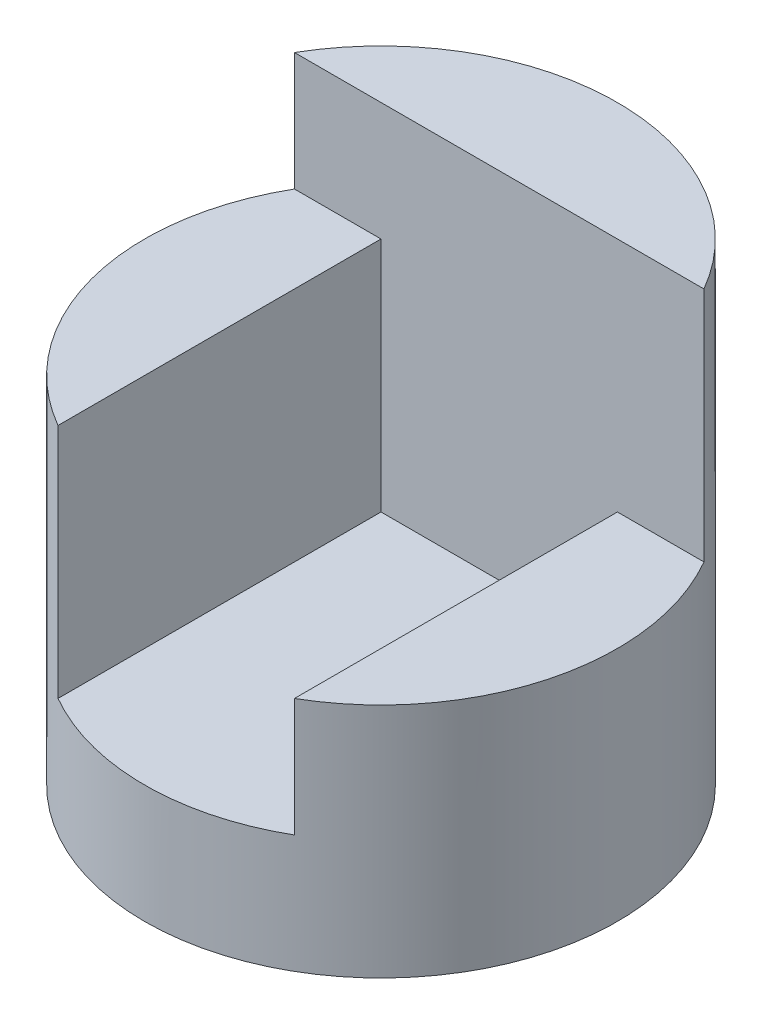
ISO-10303-21;
HEADER;
FILE_DESCRIPTION(('STEP AP214'),'2;1');
FILE_NAME('part.step','',(''),(''),'','','');
FILE_SCHEMA(('AUTOMOTIVE_DESIGN { 1 0 10303 214 1 1 1 1 }'));
ENDSEC;
DATA;
#1=APPLICATION_CONTEXT('core data for automotive mechanical design processes');
#2=APPLICATION_PROTOCOL_DEFINITION('international standard','automotive_design',2000,#1);
#3=PRODUCT_CONTEXT('',#1,'mechanical');
#4=PRODUCT('Part','Part','',(#3));
#5=PRODUCT_RELATED_PRODUCT_CATEGORY('part','',(#4));
#6=PRODUCT_DEFINITION_FORMATION('','',#4);
#7=PRODUCT_DEFINITION_CONTEXT('part definition',#1,'design');
#8=PRODUCT_DEFINITION('design','',#6,#7);
#9=PRODUCT_DEFINITION_SHAPE('','',#8);
#10=(LENGTH_UNIT() NAMED_UNIT(*) SI_UNIT(.MILLI.,.METRE.));
#11=(NAMED_UNIT(*) PLANE_ANGLE_UNIT() SI_UNIT($,.RADIAN.));
#12=(NAMED_UNIT(*) SI_UNIT($,.STERADIAN.) SOLID_ANGLE_UNIT());
#13=UNCERTAINTY_MEASURE_WITH_UNIT(LENGTH_MEASURE(1.E-05),#10,'distance_accuracy_value','');
#14=(GEOMETRIC_REPRESENTATION_CONTEXT(3) GLOBAL_UNCERTAINTY_ASSIGNED_CONTEXT((#13)) GLOBAL_UNIT_ASSIGNED_CONTEXT((#10,
#11,#12)) REPRESENTATION_CONTEXT('',''));
#15=CARTESIAN_POINT('',(0.,0.,0.));
#16=DIRECTION('',(0.,0.,1.));
#17=DIRECTION('',(1.,0.,0.));
#18=AXIS2_PLACEMENT_3D('',#15,#16,#17);
#19=CARTESIAN_POINT('',(0.,4.,0.));
#20=DIRECTION('',(0.,-1.,0.));
#21=DIRECTION('',(0.,0.,-1.));
#22=AXIS2_PLACEMENT_3D('',#19,#20,#21);
#23=CYLINDRICAL_SURFACE('',#22,2.);
#24=CARTESIAN_POINT('',(0.,0.,0.));
#25=DIRECTION('',(0.,1.,0.));
#26=DIRECTION('',(0.,0.,1.));
#27=AXIS2_PLACEMENT_3D('',#24,#25,#26);
#28=CIRCLE('',#27,2.);
#29=CARTESIAN_POINT('',(0.,0.,2.));
#30=VERTEX_POINT('',#29);
#31=EDGE_CURVE('E120',#30,#30,#28,.T.);
#32=ORIENTED_EDGE('',*,*,#31,.T.);
#33=EDGE_LOOP('',(#32));
#34=FACE_BOUND('',#33,.T.);
#35=CARTESIAN_POINT('',(0.,2.,0.));
#36=DIRECTION('',(0.,1.,0.));
#37=DIRECTION('',(0.,0.,1.));
#38=AXIS2_PLACEMENT_3D('',#35,#36,#37);
#39=CIRCLE('',#38,2.);
#40=CARTESIAN_POINT('',(1.,2.,1.73205080756888));
#41=VERTEX_POINT('',#40);
#42=CARTESIAN_POINT('',(1.73205080756888,2.,-1.));
#43=VERTEX_POINT('',#42);
#44=EDGE_CURVE('E90',#41,#43,#39,.T.);
#45=ORIENTED_EDGE('',*,*,#44,.F.);
#46=DIRECTION('',(0.,-1.,0.));
#47=VECTOR('',#46,1.);
#48=CARTESIAN_POINT('',(1.,4.,1.73205080756888));
#49=LINE('',#48,#47);
#50=CARTESIAN_POINT('',(1.,1.,1.73205080756888));
#51=VERTEX_POINT('',#50);
#52=EDGE_CURVE('E11',#51,#41,#49,.F.);
#53=ORIENTED_EDGE('',*,*,#52,.F.);
#54=CARTESIAN_POINT('',(0.,1.,0.));
#55=DIRECTION('',(0.,1.,0.));
#56=DIRECTION('',(-1.,0.,0.));
#57=AXIS2_PLACEMENT_3D('',#54,#55,#56);
#58=CIRCLE('',#57,2.);
#59=CARTESIAN_POINT('',(-1.,1.,1.73205080756888));
#60=VERTEX_POINT('',#59);
#61=EDGE_CURVE('E40',#60,#51,#58,.T.);
#62=ORIENTED_EDGE('',*,*,#61,.F.);
#63=DIRECTION('',(0.,-1.,0.));
#64=VECTOR('',#63,1.);
#65=CARTESIAN_POINT('',(-1.,4.,1.73205080756888));
#66=LINE('',#65,#64);
#67=CARTESIAN_POINT('',(-1.,3.,1.73205080756888));
#68=VERTEX_POINT('',#67);
#69=EDGE_CURVE('E129',#68,#60,#66,.T.);
#70=ORIENTED_EDGE('',*,*,#69,.F.);
#71=CARTESIAN_POINT('',(0.,3.,0.));
#72=DIRECTION('',(0.,1.,0.));
#73=DIRECTION('',(-1.,0.,0.));
#74=AXIS2_PLACEMENT_3D('',#71,#72,#73);
#75=CIRCLE('',#74,2.);
#76=CARTESIAN_POINT('',(-1.73205080756888,3.,-1.));
#77=VERTEX_POINT('',#76);
#78=EDGE_CURVE('E55',#77,#68,#75,.T.);
#79=ORIENTED_EDGE('',*,*,#78,.F.);
#80=DIRECTION('',(0.,-1.,0.));
#81=VECTOR('',#80,1.);
#82=CARTESIAN_POINT('',(-1.73205080756888,4.,-1.));
#83=LINE('',#82,#81);
#84=CARTESIAN_POINT('',(-1.73205080756888,4.,-1.));
#85=VERTEX_POINT('',#84);
#86=EDGE_CURVE('E116',#77,#85,#83,.F.);
#87=ORIENTED_EDGE('',*,*,#86,.T.);
#88=CARTESIAN_POINT('',(0.,4.,0.));
#89=DIRECTION('',(0.,1.,0.));
#90=DIRECTION('',(0.,0.,1.));
#91=AXIS2_PLACEMENT_3D('',#88,#89,#90);
#92=CIRCLE('',#91,2.);
#93=CARTESIAN_POINT('',(1.73205080756888,4.,-1.));
#94=VERTEX_POINT('',#93);
#95=EDGE_CURVE('E121',#94,#85,#92,.T.);
#96=ORIENTED_EDGE('',*,*,#95,.F.);
#97=DIRECTION('',(0.,-1.,0.));
#98=VECTOR('',#97,1.);
#99=CARTESIAN_POINT('',(1.73205080756888,4.,-1.));
#100=LINE('',#99,#98);
#101=EDGE_CURVE('E47',#94,#43,#100,.T.);
#102=ORIENTED_EDGE('',*,*,#101,.T.);
#103=EDGE_LOOP('',(#45,#53,#62,#70,#79,#87,#96,#102));
#104=FACE_BOUND('',#103,.T.);
#105=ADVANCED_FACE('F33',(#34,#104),#23,.T.);
#106=CARTESIAN_POINT('',(1.,3.,3.));
#107=DIRECTION('',(-1.,0.,0.));
#108=DIRECTION('',(0.,-1.,0.));
#109=AXIS2_PLACEMENT_3D('',#106,#107,#108);
#110=PLANE('',#109);
#111=ORIENTED_EDGE('',*,*,#52,.T.);
#112=DIRECTION('',(0.,0.,-1.));
#113=VECTOR('',#112,1.);
#114=CARTESIAN_POINT('',(1.,2.,9.));
#115=LINE('',#114,#113);
#116=CARTESIAN_POINT('',(1.,2.,-1.));
#117=VERTEX_POINT('',#116);
#118=EDGE_CURVE('E88',#41,#117,#115,.T.);
#119=ORIENTED_EDGE('',*,*,#118,.T.);
#120=DIRECTION('',(0.,1.,0.));
#121=VECTOR('',#120,1.);
#122=CARTESIAN_POINT('',(1.,3.,-1.));
#123=LINE('',#122,#121);
#124=CARTESIAN_POINT('',(1.,1.,-1.));
#125=VERTEX_POINT('',#124);
#126=EDGE_CURVE('E97',#125,#117,#123,.T.);
#127=ORIENTED_EDGE('',*,*,#126,.F.);
#128=DIRECTION('',(0.,0.,-1.));
#129=VECTOR('',#128,1.);
#130=CARTESIAN_POINT('',(1.,1.,3.));
#131=LINE('',#130,#129);
#132=EDGE_CURVE('E105',#51,#125,#131,.T.);
#133=ORIENTED_EDGE('',*,*,#132,.F.);
#134=EDGE_LOOP('',(#111,#119,#127,#133));
#135=FACE_BOUND('',#134,.T.);
#136=ADVANCED_FACE('F95',(#135),#110,.T.);
#137=CARTESIAN_POINT('',(0.,4.,0.));
#138=DIRECTION('',(0.,1.,0.));
#139=DIRECTION('',(0.,0.,1.));
#140=AXIS2_PLACEMENT_3D('',#137,#138,#139);
#141=PLANE('',#140);
#142=DIRECTION('',(-1.,0.,0.));
#143=VECTOR('',#142,1.);
#144=CARTESIAN_POINT('',(0.,4.,-1.));
#145=LINE('',#144,#143);
#146=EDGE_CURVE('E124',#94,#85,#145,.T.);
#147=ORIENTED_EDGE('',*,*,#146,.F.);
#148=ORIENTED_EDGE('',*,*,#95,.T.);
#149=EDGE_LOOP('',(#147,#148));
#150=FACE_BOUND('',#149,.T.);
#151=ADVANCED_FACE('F145',(#150),#141,.T.);
#152=CARTESIAN_POINT('',(0.,0.,0.));
#153=DIRECTION('',(0.,1.,0.));
#154=DIRECTION('',(0.,0.,1.));
#155=AXIS2_PLACEMENT_3D('',#152,#153,#154);
#156=PLANE('',#155);
#157=ORIENTED_EDGE('',*,*,#31,.F.);
#158=EDGE_LOOP('',(#157));
#159=FACE_BOUND('',#158,.T.);
#160=ADVANCED_FACE('F147',(#159),#156,.F.);
#161=CARTESIAN_POINT('',(-1.,3.,3.));
#162=DIRECTION('',(0.,1.,0.));
#163=DIRECTION('',(-1.,0.,0.));
#164=AXIS2_PLACEMENT_3D('',#161,#162,#163);
#165=PLANE('',#164);
#166=ORIENTED_EDGE('',*,*,#78,.T.);
#167=DIRECTION('',(0.,0.,-1.));
#168=VECTOR('',#167,1.);
#169=CARTESIAN_POINT('',(-1.,3.,3.));
#170=LINE('',#169,#168);
#171=CARTESIAN_POINT('',(-1.,3.,-1.));
#172=VERTEX_POINT('',#171);
#173=EDGE_CURVE('E114',#68,#172,#170,.T.);
#174=ORIENTED_EDGE('',*,*,#173,.T.);
#175=DIRECTION('',(1.,0.,0.));
#176=VECTOR('',#175,1.);
#177=CARTESIAN_POINT('',(-1.,3.,-1.));
#178=LINE('',#177,#176);
#179=EDGE_CURVE('E137',#77,#172,#178,.T.);
#180=ORIENTED_EDGE('',*,*,#179,.F.);
#181=EDGE_LOOP('',(#166,#174,#180));
#182=FACE_BOUND('',#181,.T.);
#183=ADVANCED_FACE('F152',(#182),#165,.T.);
#184=CARTESIAN_POINT('',(-1.,1.,3.));
#185=DIRECTION('',(1.,0.,0.));
#186=DIRECTION('',(0.,0.,-1.));
#187=AXIS2_PLACEMENT_3D('',#184,#185,#186);
#188=PLANE('',#187);
#189=ORIENTED_EDGE('',*,*,#69,.T.);
#190=DIRECTION('',(0.,0.,-1.));
#191=VECTOR('',#190,1.);
#192=CARTESIAN_POINT('',(-1.,1.,3.));
#193=LINE('',#192,#191);
#194=CARTESIAN_POINT('',(-1.,1.,-1.));
#195=VERTEX_POINT('',#194);
#196=EDGE_CURVE('E107',#60,#195,#193,.T.);
#197=ORIENTED_EDGE('',*,*,#196,.T.);
#198=DIRECTION('',(0.,-1.,0.));
#199=VECTOR('',#198,1.);
#200=CARTESIAN_POINT('',(-1.,1.,-1.));
#201=LINE('',#200,#199);
#202=EDGE_CURVE('E109',#172,#195,#201,.T.);
#203=ORIENTED_EDGE('',*,*,#202,.F.);
#204=ORIENTED_EDGE('',*,*,#173,.F.);
#205=EDGE_LOOP('',(#189,#197,#203,#204));
#206=FACE_BOUND('',#205,.T.);
#207=ADVANCED_FACE('F143',(#206),#188,.T.);
#208=CARTESIAN_POINT('',(1.,1.,3.));
#209=DIRECTION('',(0.,1.,0.));
#210=DIRECTION('',(-1.,0.,0.));
#211=AXIS2_PLACEMENT_3D('',#208,#209,#210);
#212=PLANE('',#211);
#213=ORIENTED_EDGE('',*,*,#61,.T.);
#214=ORIENTED_EDGE('',*,*,#132,.T.);
#215=DIRECTION('',(1.,0.,0.));
#216=VECTOR('',#215,1.);
#217=CARTESIAN_POINT('',(1.,1.,-1.));
#218=LINE('',#217,#216);
#219=EDGE_CURVE('E104',#195,#125,#218,.T.);
#220=ORIENTED_EDGE('',*,*,#219,.F.);
#221=ORIENTED_EDGE('',*,*,#196,.F.);
#222=EDGE_LOOP('',(#213,#214,#220,#221));
#223=FACE_BOUND('',#222,.T.);
#224=ADVANCED_FACE('F133',(#223),#212,.T.);
#225=CARTESIAN_POINT('',(0.,0.,-1.));
#226=DIRECTION('',(0.,0.,-1.));
#227=DIRECTION('',(-1.,0.,0.));
#228=AXIS2_PLACEMENT_3D('',#225,#226,#227);
#229=PLANE('',#228);
#230=ORIENTED_EDGE('',*,*,#126,.T.);
#231=DIRECTION('',(1.,0.,0.));
#232=VECTOR('',#231,1.);
#233=CARTESIAN_POINT('',(1.,2.,-1.));
#234=LINE('',#233,#232);
#235=EDGE_CURVE('E85',#117,#43,#234,.T.);
#236=ORIENTED_EDGE('',*,*,#235,.T.);
#237=ORIENTED_EDGE('',*,*,#101,.F.);
#238=ORIENTED_EDGE('',*,*,#146,.T.);
#239=ORIENTED_EDGE('',*,*,#86,.F.);
#240=ORIENTED_EDGE('',*,*,#179,.T.);
#241=ORIENTED_EDGE('',*,*,#202,.T.);
#242=ORIENTED_EDGE('',*,*,#219,.T.);
#243=EDGE_LOOP('',(#230,#236,#237,#238,#239,#240,#241,#242));
#244=FACE_BOUND('',#243,.T.);
#245=ADVANCED_FACE('F101',(#244),#229,.F.);
#246=CARTESIAN_POINT('',(1.,2.,9.));
#247=DIRECTION('',(0.,1.,0.));
#248=DIRECTION('',(0.,0.,1.));
#249=AXIS2_PLACEMENT_3D('',#246,#247,#248);
#250=PLANE('',#249);
#251=ORIENTED_EDGE('',*,*,#44,.T.);
#252=ORIENTED_EDGE('',*,*,#235,.F.);
#253=ORIENTED_EDGE('',*,*,#118,.F.);
#254=EDGE_LOOP('',(#251,#252,#253));
#255=FACE_BOUND('',#254,.T.);
#256=ADVANCED_FACE('F87',(#255),#250,.T.);
#257=CLOSED_SHELL('',(#105,#136,#151,#160,#183,#207,#224,#245,#256));
#258=MANIFOLD_SOLID_BREP('B2',#257);
#259=ADVANCED_BREP_SHAPE_REPRESENTATION('',(#18,#258),#14);
#260=SHAPE_DEFINITION_REPRESENTATION(#9,#259);
ENDSEC;
END-ISO-10303-21;
